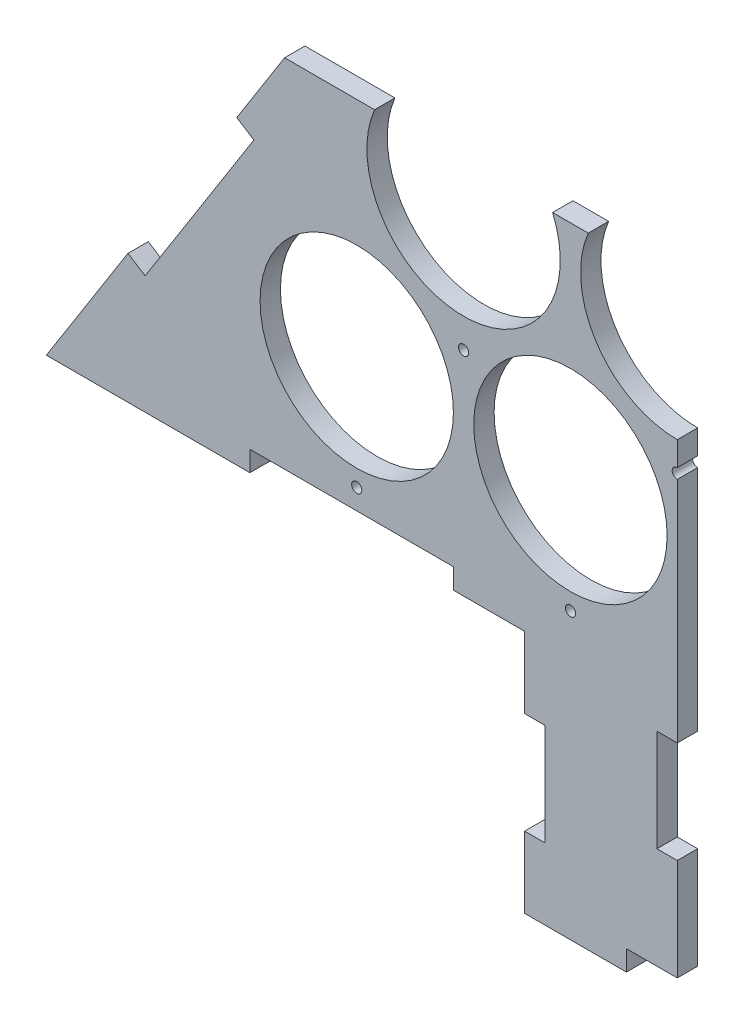
ISO-10303-21;
HEADER;
FILE_DESCRIPTION(('STEP AP214'),'2;1');
FILE_NAME('part.step','',(''),(''),'','','');
FILE_SCHEMA(('AUTOMOTIVE_DESIGN { 1 0 10303 214 1 1 1 1 }'));
ENDSEC;
DATA;
#1=APPLICATION_CONTEXT('core data for automotive mechanical design processes');
#2=APPLICATION_PROTOCOL_DEFINITION('international standard','automotive_design',2000,#1);
#3=PRODUCT_CONTEXT('',#1,'mechanical');
#4=PRODUCT('Part','Part','',(#3));
#5=PRODUCT_RELATED_PRODUCT_CATEGORY('part','',(#4));
#6=PRODUCT_DEFINITION_FORMATION('','',#4);
#7=PRODUCT_DEFINITION_CONTEXT('part definition',#1,'design');
#8=PRODUCT_DEFINITION('design','',#6,#7);
#9=PRODUCT_DEFINITION_SHAPE('','',#8);
#10=(LENGTH_UNIT() NAMED_UNIT(*) SI_UNIT(.MILLI.,.METRE.));
#11=(NAMED_UNIT(*) PLANE_ANGLE_UNIT() SI_UNIT($,.RADIAN.));
#12=(NAMED_UNIT(*) SI_UNIT($,.STERADIAN.) SOLID_ANGLE_UNIT());
#13=UNCERTAINTY_MEASURE_WITH_UNIT(LENGTH_MEASURE(1.E-05),#10,'distance_accuracy_value','');
#14=(GEOMETRIC_REPRESENTATION_CONTEXT(3) GLOBAL_UNCERTAINTY_ASSIGNED_CONTEXT((#13)) GLOBAL_UNIT_ASSIGNED_CONTEXT((#10,
#11,#12)) REPRESENTATION_CONTEXT('',''));
#15=CARTESIAN_POINT('',(0.,0.,0.));
#16=DIRECTION('',(0.,0.,1.));
#17=DIRECTION('',(1.,0.,0.));
#18=AXIS2_PLACEMENT_3D('',#15,#16,#17);
#19=CARTESIAN_POINT('',(0.,414.561180134828,0.));
#20=DIRECTION('',(-1.,0.,0.));
#21=DIRECTION('',(0.,0.,1.));
#22=AXIS2_PLACEMENT_3D('',#19,#20,#21);
#23=PLANE('',#22);
#24=DIRECTION('',(0.,-1.,0.));
#25=VECTOR('',#24,1.);
#26=CARTESIAN_POINT('',(0.,414.561180134828,0.));
#27=LINE('',#26,#25);
#28=CARTESIAN_POINT('',(0.,-135.642859016217,0.));
#29=VERTEX_POINT('',#28);
#30=CARTESIAN_POINT('',(0.,-185.642859016217,0.));
#31=VERTEX_POINT('',#30);
#32=EDGE_CURVE('E277',#29,#31,#27,.T.);
#33=ORIENTED_EDGE('',*,*,#32,.F.);
#34=DIRECTION('',(0.,0.,1.));
#35=VECTOR('',#34,1.);
#36=CARTESIAN_POINT('',(0.,-135.642859016217,0.));
#37=LINE('',#36,#35);
#38=CARTESIAN_POINT('',(0.,-135.642859016217,10.));
#39=VERTEX_POINT('',#38);
#40=EDGE_CURVE('E256',#29,#39,#37,.T.);
#41=ORIENTED_EDGE('',*,*,#40,.T.);
#42=DIRECTION('',(0.,-1.,0.));
#43=VECTOR('',#42,1.);
#44=CARTESIAN_POINT('',(0.,414.561180134828,10.));
#45=LINE('',#44,#43);
#46=CARTESIAN_POINT('',(0.,-185.642859016217,10.));
#47=VERTEX_POINT('',#46);
#48=EDGE_CURVE('E274',#39,#47,#45,.T.);
#49=ORIENTED_EDGE('',*,*,#48,.T.);
#50=DIRECTION('',(0.,0.,1.));
#51=VECTOR('',#50,1.);
#52=CARTESIAN_POINT('',(0.,-185.642859016217,0.));
#53=LINE('',#52,#51);
#54=EDGE_CURVE('E44',#31,#47,#53,.T.);
#55=ORIENTED_EDGE('',*,*,#54,.F.);
#56=EDGE_LOOP('',(#33,#41,#49,#55));
#57=FACE_BOUND('',#56,.T.);
#58=ADVANCED_FACE('F36',(#57),#23,.F.);
#59=CARTESIAN_POINT('',(-75.,-75.6428590162172,0.));
#60=DIRECTION('',(-1.,0.,0.));
#61=DIRECTION('',(0.,0.,1.));
#62=AXIS2_PLACEMENT_3D('',#59,#60,#61);
#63=PLANE('',#62);
#64=DIRECTION('',(0.,0.,1.));
#65=VECTOR('',#64,1.);
#66=CARTESIAN_POINT('',(-75.,-110.642859016217,0.));
#67=LINE('',#66,#65);
#68=CARTESIAN_POINT('',(-75.,-110.642859016217,0.));
#69=VERTEX_POINT('',#68);
#70=CARTESIAN_POINT('',(-75.,-110.642859016217,10.));
#71=VERTEX_POINT('',#70);
#72=EDGE_CURVE('E311',#69,#71,#67,.T.);
#73=ORIENTED_EDGE('',*,*,#72,.T.);
#74=DIRECTION('',(0.,-1.,0.));
#75=VECTOR('',#74,1.);
#76=CARTESIAN_POINT('',(-75.,-75.6428590162172,10.));
#77=LINE('',#76,#75);
#78=CARTESIAN_POINT('',(-75.,-75.6428590162172,10.));
#79=VERTEX_POINT('',#78);
#80=EDGE_CURVE('E341',#79,#71,#77,.T.);
#81=ORIENTED_EDGE('',*,*,#80,.F.);
#82=DIRECTION('',(0.,0.,1.));
#83=VECTOR('',#82,1.);
#84=CARTESIAN_POINT('',(-75.,-75.6428590162172,0.));
#85=LINE('',#84,#83);
#86=CARTESIAN_POINT('',(-75.,-75.6428590162172,0.));
#87=VERTEX_POINT('',#86);
#88=EDGE_CURVE('E347',#87,#79,#85,.T.);
#89=ORIENTED_EDGE('',*,*,#88,.F.);
#90=DIRECTION('',(0.,-1.,0.));
#91=VECTOR('',#90,1.);
#92=CARTESIAN_POINT('',(-75.,-75.6428590162172,0.));
#93=LINE('',#92,#91);
#94=EDGE_CURVE('E333',#87,#69,#93,.T.);
#95=ORIENTED_EDGE('',*,*,#94,.T.);
#96=EDGE_LOOP('',(#73,#81,#89,#95));
#97=FACE_BOUND('',#96,.T.);
#98=ADVANCED_FACE('F505',(#97),#63,.T.);
#99=CARTESIAN_POINT('',(-75.,-195.642859016217,0.));
#100=DIRECTION('',(0.,-1.,0.));
#101=DIRECTION('',(1.,0.,0.));
#102=AXIS2_PLACEMENT_3D('',#99,#100,#101);
#103=PLANE('',#102);
#104=DIRECTION('',(0.,0.,1.));
#105=VECTOR('',#104,1.);
#106=CARTESIAN_POINT('',(-25.,-195.642859016217,0.));
#107=LINE('',#106,#105);
#108=CARTESIAN_POINT('',(-25.,-195.642859016217,0.));
#109=VERTEX_POINT('',#108);
#110=CARTESIAN_POINT('',(-25.,-195.642859016217,10.));
#111=VERTEX_POINT('',#110);
#112=EDGE_CURVE('E326',#109,#111,#107,.T.);
#113=ORIENTED_EDGE('',*,*,#112,.T.);
#114=DIRECTION('',(1.,0.,0.));
#115=VECTOR('',#114,1.);
#116=CARTESIAN_POINT('',(-75.,-195.642859016217,10.));
#117=LINE('',#116,#115);
#118=CARTESIAN_POINT('',(-75.,-195.642859016217,10.));
#119=VERTEX_POINT('',#118);
#120=EDGE_CURVE('E344',#119,#111,#117,.T.);
#121=ORIENTED_EDGE('',*,*,#120,.F.);
#122=DIRECTION('',(0.,0.,1.));
#123=VECTOR('',#122,1.);
#124=CARTESIAN_POINT('',(-75.,-195.642859016217,0.));
#125=LINE('',#124,#123);
#126=CARTESIAN_POINT('',(-75.,-195.642859016217,0.));
#127=VERTEX_POINT('',#126);
#128=EDGE_CURVE('E340',#127,#119,#125,.T.);
#129=ORIENTED_EDGE('',*,*,#128,.F.);
#130=DIRECTION('',(1.,0.,0.));
#131=VECTOR('',#130,1.);
#132=CARTESIAN_POINT('',(-75.,-195.642859016217,0.));
#133=LINE('',#132,#131);
#134=EDGE_CURVE('E336',#127,#109,#133,.T.);
#135=ORIENTED_EDGE('',*,*,#134,.T.);
#136=EDGE_LOOP('',(#113,#121,#129,#135));
#137=FACE_BOUND('',#136,.T.);
#138=ADVANCED_FACE('F485',(#137),#103,.T.);
#139=CARTESIAN_POINT('',(310.,-75.6428590162171,10.));
#140=DIRECTION('',(0.,1.,0.));
#141=DIRECTION('',(-1.,0.,0.));
#142=AXIS2_PLACEMENT_3D('',#139,#140,#141);
#143=PLANE('',#142);
#144=DIRECTION('',(1.,0.,0.));
#145=VECTOR('',#144,1.);
#146=CARTESIAN_POINT('',(310.,-75.6428590162171,0.));
#147=LINE('',#146,#145);
#148=CARTESIAN_POINT('',(-110.,-75.6428590162172,0.));
#149=VERTEX_POINT('',#148);
#150=EDGE_CURVE('E448',#149,#87,#147,.T.);
#151=ORIENTED_EDGE('',*,*,#150,.T.);
#152=ORIENTED_EDGE('',*,*,#88,.T.);
#153=DIRECTION('',(1.,0.,0.));
#154=VECTOR('',#153,1.);
#155=CARTESIAN_POINT('',(310.,-75.6428590162171,10.));
#156=LINE('',#155,#154);
#157=CARTESIAN_POINT('',(-110.,-75.6428590162172,10.));
#158=VERTEX_POINT('',#157);
#159=EDGE_CURVE('E455',#158,#79,#156,.T.);
#160=ORIENTED_EDGE('',*,*,#159,.F.);
#161=DIRECTION('',(0.,0.,1.));
#162=VECTOR('',#161,1.);
#163=CARTESIAN_POINT('',(-110.,-75.6428590162172,0.));
#164=LINE('',#163,#162);
#165=EDGE_CURVE('E425',#149,#158,#164,.T.);
#166=ORIENTED_EDGE('',*,*,#165,.F.);
#167=EDGE_LOOP('',(#151,#152,#160,#166));
#168=FACE_BOUND('',#167,.T.);
#169=ADVANCED_FACE('F38',(#168),#143,.F.);
#170=CARTESIAN_POINT('',(-310.,-75.6428590162172,0.));
#171=VERTEX_POINT('',#170);
#172=CARTESIAN_POINT('',(-210.,-75.6428590162172,0.));
#173=VERTEX_POINT('',#172);
#174=EDGE_CURVE('E459',#171,#173,#147,.T.);
#175=ORIENTED_EDGE('',*,*,#174,.T.);
#176=DIRECTION('',(0.,0.,1.));
#177=VECTOR('',#176,1.);
#178=CARTESIAN_POINT('',(-210.,-75.6428590162172,0.));
#179=LINE('',#178,#177);
#180=CARTESIAN_POINT('',(-210.,-75.6428590162172,10.));
#181=VERTEX_POINT('',#180);
#182=EDGE_CURVE('E413',#173,#181,#179,.T.);
#183=ORIENTED_EDGE('',*,*,#182,.T.);
#184=CARTESIAN_POINT('',(-310.,-75.6428590162172,10.));
#185=VERTEX_POINT('',#184);
#186=EDGE_CURVE('E451',#185,#181,#156,.T.);
#187=ORIENTED_EDGE('',*,*,#186,.F.);
#188=DIRECTION('',(0.,0.,-1.));
#189=VECTOR('',#188,1.);
#190=CARTESIAN_POINT('',(-310.,-75.6428590162172,10.));
#191=LINE('',#190,#189);
#192=EDGE_CURVE('E458',#185,#171,#191,.T.);
#193=ORIENTED_EDGE('',*,*,#192,.T.);
#194=EDGE_LOOP('',(#175,#183,#187,#193));
#195=FACE_BOUND('',#194,.T.);
#196=ADVANCED_FACE('F608',(#195),#143,.F.);
#197=CARTESIAN_POINT('',(-310.,-75.6428590162172,10.));
#198=DIRECTION('',(0.845179377846631,-0.53448275862069,0.));
#199=DIRECTION('',(0.53448275862069,0.845179377846631,0.));
#200=AXIS2_PLACEMENT_3D('',#197,#198,#199);
#201=PLANE('',#200);
#202=DIRECTION('',(-0.53448275862069,-0.845179377846631,0.));
#203=VECTOR('',#202,1.);
#204=CARTESIAN_POINT('',(-310.,-75.6428590162172,10.));
#205=LINE('',#204,#203);
#206=CARTESIAN_POINT('',(-192.942106645631,109.461180134828,10.));
#207=VERTEX_POINT('',#206);
#208=CARTESIAN_POINT('',(-216.465517241379,72.2635321069431,10.));
#209=VERTEX_POINT('',#208);
#210=EDGE_CURVE('E456',#207,#209,#205,.T.);
#211=ORIENTED_EDGE('',*,*,#210,.F.);
#212=DIRECTION('',(0.,0.,-1.));
#213=VECTOR('',#212,1.);
#214=CARTESIAN_POINT('',(-192.942106645631,109.461180134828,10.));
#215=LINE('',#214,#213);
#216=CARTESIAN_POINT('',(-192.942106645631,109.461180134828,0.));
#217=VERTEX_POINT('',#216);
#218=EDGE_CURVE('E271',#207,#217,#215,.T.);
#219=ORIENTED_EDGE('',*,*,#218,.T.);
#220=DIRECTION('',(-0.53448275862069,-0.845179377846631,0.));
#221=VECTOR('',#220,1.);
#222=CARTESIAN_POINT('',(-310.,-75.6428590162172,0.));
#223=LINE('',#222,#221);
#224=CARTESIAN_POINT('',(-216.465517241379,72.2635321069431,0.));
#225=VERTEX_POINT('',#224);
#226=EDGE_CURVE('E463',#217,#225,#223,.T.);
#227=ORIENTED_EDGE('',*,*,#226,.T.);
#228=DIRECTION('',(0.,0.,1.));
#229=VECTOR('',#228,1.);
#230=CARTESIAN_POINT('',(-216.465517241379,72.2635321069431,0.));
#231=LINE('',#230,#229);
#232=EDGE_CURVE('E394',#225,#209,#231,.T.);
#233=ORIENTED_EDGE('',*,*,#232,.T.);
#234=EDGE_LOOP('',(#211,#219,#227,#233));
#235=FACE_BOUND('',#234,.T.);
#236=ADVANCED_FACE('F598',(#235),#201,.F.);
#237=CARTESIAN_POINT('',(0.,0.,10.));
#238=DIRECTION('',(0.,0.,-1.));
#239=DIRECTION('',(-1.,0.,0.));
#240=AXIS2_PLACEMENT_3D('',#237,#238,#239);
#241=PLANE('',#240);
#242=CARTESIAN_POINT('',(-157.5,-55.6428590162172,10.));
#243=DIRECTION('',(0.,0.,1.));
#244=DIRECTION('',(1.,0.,0.));
#245=AXIS2_PLACEMENT_3D('',#242,#243,#244);
#246=CIRCLE('',#245,2.5);
#247=CARTESIAN_POINT('',(-155.,-55.6428590162172,10.));
#248=VERTEX_POINT('',#247);
#249=EDGE_CURVE('E357',#248,#248,#246,.T.);
#250=ORIENTED_EDGE('',*,*,#249,.F.);
#251=EDGE_LOOP('',(#250));
#252=FACE_BOUND('',#251,.T.);
#253=CARTESIAN_POINT('',(-105.,29.0473750965556,10.));
#254=DIRECTION('',(0.,0.,1.));
#255=DIRECTION('',(1.,0.,0.));
#256=AXIS2_PLACEMENT_3D('',#253,#254,#255);
#257=CIRCLE('',#256,2.49999999999999);
#258=CARTESIAN_POINT('',(-102.5,29.0473750965556,10.));
#259=VERTEX_POINT('',#258);
#260=EDGE_CURVE('E363',#259,#259,#257,.T.);
#261=ORIENTED_EDGE('',*,*,#260,.F.);
#262=EDGE_LOOP('',(#261));
#263=FACE_BOUND('',#262,.T.);
#264=CARTESIAN_POINT('',(-52.5,-55.6428590162172,10.));
#265=DIRECTION('',(0.,0.,1.));
#266=DIRECTION('',(1.,0.,0.));
#267=AXIS2_PLACEMENT_3D('',#264,#265,#266);
#268=CIRCLE('',#267,2.5);
#269=CARTESIAN_POINT('',(-50.,-55.6428590162172,10.));
#270=VERTEX_POINT('',#269);
#271=EDGE_CURVE('E369',#270,#270,#268,.T.);
#272=ORIENTED_EDGE('',*,*,#271,.F.);
#273=EDGE_LOOP('',(#272));
#274=FACE_BOUND('',#273,.T.);
#275=CARTESIAN_POINT('',(-157.5,0.,10.));
#276=DIRECTION('',(0.,0.,1.));
#277=DIRECTION('',(1.,0.,0.));
#278=AXIS2_PLACEMENT_3D('',#275,#276,#277);
#279=CIRCLE('',#278,47.5);
#280=CARTESIAN_POINT('',(-110.,0.,10.));
#281=VERTEX_POINT('',#280);
#282=EDGE_CURVE('E445',#281,#281,#279,.T.);
#283=ORIENTED_EDGE('',*,*,#282,.F.);
#284=EDGE_LOOP('',(#283));
#285=FACE_BOUND('',#284,.T.);
#286=CARTESIAN_POINT('',(-52.5,0.,10.));
#287=DIRECTION('',(0.,0.,1.));
#288=DIRECTION('',(1.,0.,0.));
#289=AXIS2_PLACEMENT_3D('',#286,#287,#288);
#290=CIRCLE('',#289,47.5);
#291=CARTESIAN_POINT('',(-4.99999999999998,0.,10.));
#292=VERTEX_POINT('',#291);
#293=EDGE_CURVE('E439',#292,#292,#290,.T.);
#294=ORIENTED_EDGE('',*,*,#293,.F.);
#295=EDGE_LOOP('',(#294));
#296=FACE_BOUND('',#295,.T.);
#297=ORIENTED_EDGE('',*,*,#48,.F.);
#298=DIRECTION('',(1.,0.,0.));
#299=VECTOR('',#298,1.);
#300=CARTESIAN_POINT('',(0.,-135.642859016217,10.));
#301=LINE('',#300,#299);
#302=CARTESIAN_POINT('',(-10.,-135.642859016217,10.));
#303=VERTEX_POINT('',#302);
#304=EDGE_CURVE('E248',#303,#39,#301,.T.);
#305=ORIENTED_EDGE('',*,*,#304,.F.);
#306=DIRECTION('',(0.,-1.,0.));
#307=VECTOR('',#306,1.);
#308=CARTESIAN_POINT('',(-10.,-135.642859016217,10.));
#309=LINE('',#308,#307);
#310=CARTESIAN_POINT('',(-10.,-85.6428590162172,10.));
#311=VERTEX_POINT('',#310);
#312=EDGE_CURVE('E250',#311,#303,#309,.T.);
#313=ORIENTED_EDGE('',*,*,#312,.F.);
#314=DIRECTION('',(-1.,0.,0.));
#315=VECTOR('',#314,1.);
#316=CARTESIAN_POINT('',(0.,-85.6428590162172,10.));
#317=LINE('',#316,#315);
#318=CARTESIAN_POINT('',(0.,-85.6428590162172,10.));
#319=VERTEX_POINT('',#318);
#320=EDGE_CURVE('E228',#319,#311,#317,.T.);
#321=ORIENTED_EDGE('',*,*,#320,.F.);
#322=CARTESIAN_POINT('',(0.,26.5473750965556,10.));
#323=VERTEX_POINT('',#322);
#324=EDGE_CURVE('E278',#323,#319,#45,.T.);
#325=ORIENTED_EDGE('',*,*,#324,.F.);
#326=CARTESIAN_POINT('',(0.,29.0473750965556,10.));
#327=DIRECTION('',(0.,0.,1.));
#328=DIRECTION('',(1.,0.,0.));
#329=AXIS2_PLACEMENT_3D('',#326,#327,#328);
#330=CIRCLE('',#329,2.49999999999999);
#331=CARTESIAN_POINT('',(0.,31.5473750965556,10.));
#332=VERTEX_POINT('',#331);
#333=EDGE_CURVE('E350',#332,#323,#330,.T.);
#334=ORIENTED_EDGE('',*,*,#333,.F.);
#335=CARTESIAN_POINT('',(0.,43.432667397366,10.));
#336=VERTEX_POINT('',#335);
#337=EDGE_CURVE('E281',#336,#332,#45,.T.);
#338=ORIENTED_EDGE('',*,*,#337,.F.);
#339=CARTESIAN_POINT('',(0.,90.932667397366,10.));
#340=DIRECTION('',(0.,0.,1.));
#341=DIRECTION('',(1.,0.,0.));
#342=AXIS2_PLACEMENT_3D('',#339,#340,#341);
#343=CIRCLE('',#342,47.5);
#344=CARTESIAN_POINT('',(-43.7372177411607,109.461180134828,10.));
#345=VERTEX_POINT('',#344);
#346=EDGE_CURVE('E429',#345,#336,#343,.T.);
#347=ORIENTED_EDGE('',*,*,#346,.F.);
#348=DIRECTION('',(1.,0.,0.));
#349=VECTOR('',#348,1.);
#350=CARTESIAN_POINT('',(0.,109.461180134828,10.));
#351=LINE('',#350,#349);
#352=CARTESIAN_POINT('',(-61.2627822588393,109.461180134828,10.));
#353=VERTEX_POINT('',#352);
#354=EDGE_CURVE('E259',#353,#345,#351,.T.);
#355=ORIENTED_EDGE('',*,*,#354,.F.);
#356=CARTESIAN_POINT('',(-105.,90.932667397366,10.));
#357=DIRECTION('',(0.,0.,1.));
#358=DIRECTION('',(1.,0.,0.));
#359=AXIS2_PLACEMENT_3D('',#356,#357,#358);
#360=CIRCLE('',#359,47.5);
#361=CARTESIAN_POINT('',(-148.737217741161,109.461180134828,10.));
#362=VERTEX_POINT('',#361);
#363=EDGE_CURVE('E433',#362,#353,#360,.T.);
#364=ORIENTED_EDGE('',*,*,#363,.F.);
#365=EDGE_CURVE('E59',#207,#362,#351,.T.);
#366=ORIENTED_EDGE('',*,*,#365,.F.);
#367=ORIENTED_EDGE('',*,*,#210,.T.);
#368=DIRECTION('',(-0.84517937784663,0.534482758620691,0.));
#369=VECTOR('',#368,1.);
#370=CARTESIAN_POINT('',(-208.013723462913,66.9187045207363,10.));
#371=LINE('',#370,#369);
#372=CARTESIAN_POINT('',(-208.013723462913,66.9187045207363,10.));
#373=VERTEX_POINT('',#372);
#374=EDGE_CURVE('E380',#373,#209,#371,.T.);
#375=ORIENTED_EDGE('',*,*,#374,.F.);
#376=DIRECTION('',(0.534482758620691,0.84517937784663,0.));
#377=VECTOR('',#376,1.);
#378=CARTESIAN_POINT('',(-261.461999324982,-17.5992332639267,10.));
#379=LINE('',#378,#377);
#380=CARTESIAN_POINT('',(-261.461999324982,-17.5992332639267,10.));
#381=VERTEX_POINT('',#380);
#382=EDGE_CURVE('E389',#381,#373,#379,.T.);
#383=ORIENTED_EDGE('',*,*,#382,.F.);
#384=DIRECTION('',(0.84517937784663,-0.534482758620692,0.));
#385=VECTOR('',#384,1.);
#386=CARTESIAN_POINT('',(-269.913793103448,-12.2544056777198,10.));
#387=LINE('',#386,#385);
#388=CARTESIAN_POINT('',(-269.913793103448,-12.2544056777198,10.));
#389=VERTEX_POINT('',#388);
#390=EDGE_CURVE('E356',#389,#381,#387,.T.);
#391=ORIENTED_EDGE('',*,*,#390,.F.);
#392=EDGE_CURVE('E454',#389,#185,#205,.T.);
#393=ORIENTED_EDGE('',*,*,#392,.T.);
#394=ORIENTED_EDGE('',*,*,#186,.T.);
#395=DIRECTION('',(0.,-1.,0.));
#396=VECTOR('',#395,1.);
#397=CARTESIAN_POINT('',(-210.,-75.6428590162172,10.));
#398=LINE('',#397,#396);
#399=CARTESIAN_POINT('',(-210.,-65.6428590162172,10.));
#400=VERTEX_POINT('',#399);
#401=EDGE_CURVE('E397',#400,#181,#398,.T.);
#402=ORIENTED_EDGE('',*,*,#401,.F.);
#403=DIRECTION('',(-1.,0.,0.));
#404=VECTOR('',#403,1.);
#405=CARTESIAN_POINT('',(-210.,-65.6428590162172,10.));
#406=LINE('',#405,#404);
#407=CARTESIAN_POINT('',(-110.,-65.6428590162172,10.));
#408=VERTEX_POINT('',#407);
#409=EDGE_CURVE('E407',#408,#400,#406,.T.);
#410=ORIENTED_EDGE('',*,*,#409,.F.);
#411=DIRECTION('',(0.,1.,0.));
#412=VECTOR('',#411,1.);
#413=CARTESIAN_POINT('',(-110.,-75.6428590162172,10.));
#414=LINE('',#413,#412);
#415=EDGE_CURVE('E415',#158,#408,#414,.T.);
#416=ORIENTED_EDGE('',*,*,#415,.F.);
#417=ORIENTED_EDGE('',*,*,#159,.T.);
#418=ORIENTED_EDGE('',*,*,#80,.T.);
#419=DIRECTION('',(-1.,0.,0.));
#420=VECTOR('',#419,1.);
#421=CARTESIAN_POINT('',(-75.,-110.642859016217,10.));
#422=LINE('',#421,#420);
#423=CARTESIAN_POINT('',(-65.,-110.642859016217,10.));
#424=VERTEX_POINT('',#423);
#425=EDGE_CURVE('E296',#424,#71,#422,.T.);
#426=ORIENTED_EDGE('',*,*,#425,.F.);
#427=DIRECTION('',(0.,1.,0.));
#428=VECTOR('',#427,1.);
#429=CARTESIAN_POINT('',(-65.,-110.642859016217,10.));
#430=LINE('',#429,#428);
#431=CARTESIAN_POINT('',(-65.,-160.642859016217,10.));
#432=VERTEX_POINT('',#431);
#433=EDGE_CURVE('E306',#432,#424,#430,.T.);
#434=ORIENTED_EDGE('',*,*,#433,.F.);
#435=DIRECTION('',(1.,0.,0.));
#436=VECTOR('',#435,1.);
#437=CARTESIAN_POINT('',(-75.,-160.642859016217,10.));
#438=LINE('',#437,#436);
#439=CARTESIAN_POINT('',(-75.,-160.642859016217,10.));
#440=VERTEX_POINT('',#439);
#441=EDGE_CURVE('E303',#440,#432,#438,.T.);
#442=ORIENTED_EDGE('',*,*,#441,.F.);
#443=EDGE_CURVE('E314',#440,#119,#77,.T.);
#444=ORIENTED_EDGE('',*,*,#443,.T.);
#445=ORIENTED_EDGE('',*,*,#120,.T.);
#446=DIRECTION('',(0.,-1.,0.));
#447=VECTOR('',#446,1.);
#448=CARTESIAN_POINT('',(-25.,-195.642859016217,10.));
#449=LINE('',#448,#447);
#450=CARTESIAN_POINT('',(-25.,-185.642859016217,10.));
#451=VERTEX_POINT('',#450);
#452=EDGE_CURVE('E291',#451,#111,#449,.T.);
#453=ORIENTED_EDGE('',*,*,#452,.F.);
#454=DIRECTION('',(-1.,0.,0.));
#455=VECTOR('',#454,1.);
#456=CARTESIAN_POINT('',(-25.,-185.642859016217,10.));
#457=LINE('',#456,#455);
#458=EDGE_CURVE('E324',#47,#451,#457,.T.);
#459=ORIENTED_EDGE('',*,*,#458,.F.);
#460=EDGE_LOOP('',(#297,#305,#313,#321,#325,#334,#338,#347,#355,#364,#366,#367,#375,#383,#391,
#393,#394,#402,#410,#416,#417,#418,#426,#434,#442,#444,#445,#453,#459));
#461=FACE_BOUND('',#460,.T.);
#462=ADVANCED_FACE('F478',(#252,#263,#274,#285,#296,#461),#241,.F.);
#463=CARTESIAN_POINT('',(0.,0.,0.));
#464=DIRECTION('',(0.,0.,-1.));
#465=DIRECTION('',(-1.,0.,0.));
#466=AXIS2_PLACEMENT_3D('',#463,#464,#465);
#467=PLANE('',#466);
#468=DIRECTION('',(1.,0.,0.));
#469=VECTOR('',#468,1.);
#470=CARTESIAN_POINT('',(0.,-135.642859016217,0.));
#471=LINE('',#470,#469);
#472=CARTESIAN_POINT('',(-10.,-135.642859016217,0.));
#473=VERTEX_POINT('',#472);
#474=EDGE_CURVE('E241',#473,#29,#471,.T.);
#475=ORIENTED_EDGE('',*,*,#474,.T.);
#476=ORIENTED_EDGE('',*,*,#32,.T.);
#477=DIRECTION('',(-1.,0.,0.));
#478=VECTOR('',#477,1.);
#479=CARTESIAN_POINT('',(-25.,-185.642859016217,0.));
#480=LINE('',#479,#478);
#481=CARTESIAN_POINT('',(-25.,-185.642859016217,0.));
#482=VERTEX_POINT('',#481);
#483=EDGE_CURVE('E323',#31,#482,#480,.T.);
#484=ORIENTED_EDGE('',*,*,#483,.T.);
#485=DIRECTION('',(0.,-1.,0.));
#486=VECTOR('',#485,1.);
#487=CARTESIAN_POINT('',(-25.,-195.642859016217,0.));
#488=LINE('',#487,#486);
#489=EDGE_CURVE('E320',#482,#109,#488,.T.);
#490=ORIENTED_EDGE('',*,*,#489,.T.);
#491=ORIENTED_EDGE('',*,*,#134,.F.);
#492=CARTESIAN_POINT('',(-75.,-160.642859016217,0.));
#493=VERTEX_POINT('',#492);
#494=EDGE_CURVE('E337',#493,#127,#93,.T.);
#495=ORIENTED_EDGE('',*,*,#494,.F.);
#496=DIRECTION('',(1.,0.,0.));
#497=VECTOR('',#496,1.);
#498=CARTESIAN_POINT('',(-75.,-160.642859016217,0.));
#499=LINE('',#498,#497);
#500=CARTESIAN_POINT('',(-65.,-160.642859016217,0.));
#501=VERTEX_POINT('',#500);
#502=EDGE_CURVE('E292',#493,#501,#499,.T.);
#503=ORIENTED_EDGE('',*,*,#502,.T.);
#504=DIRECTION('',(0.,1.,0.));
#505=VECTOR('',#504,1.);
#506=CARTESIAN_POINT('',(-65.,-110.642859016217,0.));
#507=LINE('',#506,#505);
#508=CARTESIAN_POINT('',(-65.,-110.642859016217,0.));
#509=VERTEX_POINT('',#508);
#510=EDGE_CURVE('E295',#501,#509,#507,.T.);
#511=ORIENTED_EDGE('',*,*,#510,.T.);
#512=DIRECTION('',(-1.,0.,0.));
#513=VECTOR('',#512,1.);
#514=CARTESIAN_POINT('',(-75.,-110.642859016217,0.));
#515=LINE('',#514,#513);
#516=EDGE_CURVE('E299',#509,#69,#515,.T.);
#517=ORIENTED_EDGE('',*,*,#516,.T.);
#518=ORIENTED_EDGE('',*,*,#94,.F.);
#519=ORIENTED_EDGE('',*,*,#150,.F.);
#520=DIRECTION('',(0.,1.,0.));
#521=VECTOR('',#520,1.);
#522=CARTESIAN_POINT('',(-110.,-75.6428590162172,0.));
#523=LINE('',#522,#521);
#524=CARTESIAN_POINT('',(-110.,-65.6428590162172,0.));
#525=VERTEX_POINT('',#524);
#526=EDGE_CURVE('E406',#149,#525,#523,.T.);
#527=ORIENTED_EDGE('',*,*,#526,.T.);
#528=DIRECTION('',(-1.,0.,0.));
#529=VECTOR('',#528,1.);
#530=CARTESIAN_POINT('',(-210.,-65.6428590162172,0.));
#531=LINE('',#530,#529);
#532=CARTESIAN_POINT('',(-210.,-65.6428590162172,0.));
#533=VERTEX_POINT('',#532);
#534=EDGE_CURVE('E410',#525,#533,#531,.T.);
#535=ORIENTED_EDGE('',*,*,#534,.T.);
#536=DIRECTION('',(0.,-1.,0.));
#537=VECTOR('',#536,1.);
#538=CARTESIAN_POINT('',(-210.,-75.6428590162172,0.));
#539=LINE('',#538,#537);
#540=EDGE_CURVE('E403',#533,#173,#539,.T.);
#541=ORIENTED_EDGE('',*,*,#540,.T.);
#542=ORIENTED_EDGE('',*,*,#174,.F.);
#543=CARTESIAN_POINT('',(-269.913793103448,-12.2544056777201,0.));
#544=VERTEX_POINT('',#543);
#545=EDGE_CURVE('E462',#544,#171,#223,.T.);
#546=ORIENTED_EDGE('',*,*,#545,.F.);
#547=DIRECTION('',(0.84517937784663,-0.534482758620692,0.));
#548=VECTOR('',#547,1.);
#549=CARTESIAN_POINT('',(-269.913793103448,-12.2544056777198,0.));
#550=LINE('',#549,#548);
#551=CARTESIAN_POINT('',(-261.461999324982,-17.5992332639267,0.));
#552=VERTEX_POINT('',#551);
#553=EDGE_CURVE('E376',#544,#552,#550,.T.);
#554=ORIENTED_EDGE('',*,*,#553,.T.);
#555=DIRECTION('',(0.534482758620691,0.84517937784663,0.));
#556=VECTOR('',#555,1.);
#557=CARTESIAN_POINT('',(-261.461999324982,-17.5992332639267,0.));
#558=LINE('',#557,#556);
#559=CARTESIAN_POINT('',(-208.013723462913,66.9187045207363,0.));
#560=VERTEX_POINT('',#559);
#561=EDGE_CURVE('E379',#552,#560,#558,.T.);
#562=ORIENTED_EDGE('',*,*,#561,.T.);
#563=DIRECTION('',(-0.84517937784663,0.534482758620691,0.));
#564=VECTOR('',#563,1.);
#565=CARTESIAN_POINT('',(-208.013723462913,66.9187045207363,0.));
#566=LINE('',#565,#564);
#567=EDGE_CURVE('E383',#560,#225,#566,.T.);
#568=ORIENTED_EDGE('',*,*,#567,.T.);
#569=ORIENTED_EDGE('',*,*,#226,.F.);
#570=DIRECTION('',(1.,0.,0.));
#571=VECTOR('',#570,1.);
#572=CARTESIAN_POINT('',(0.,109.461180134828,0.));
#573=LINE('',#572,#571);
#574=CARTESIAN_POINT('',(-148.737217741161,109.461180134828,0.));
#575=VERTEX_POINT('',#574);
#576=EDGE_CURVE('E265',#217,#575,#573,.T.);
#577=ORIENTED_EDGE('',*,*,#576,.T.);
#578=CARTESIAN_POINT('',(-105.,90.932667397366,0.));
#579=DIRECTION('',(0.,0.,1.));
#580=DIRECTION('',(1.,0.,0.));
#581=AXIS2_PLACEMENT_3D('',#578,#579,#580);
#582=CIRCLE('',#581,47.5);
#583=CARTESIAN_POINT('',(-61.2627822588393,109.461180134828,0.));
#584=VERTEX_POINT('',#583);
#585=EDGE_CURVE('E431',#575,#584,#582,.T.);
#586=ORIENTED_EDGE('',*,*,#585,.T.);
#587=CARTESIAN_POINT('',(-43.7372177411607,109.461180134828,0.));
#588=VERTEX_POINT('',#587);
#589=EDGE_CURVE('E262',#584,#588,#573,.T.);
#590=ORIENTED_EDGE('',*,*,#589,.T.);
#591=CARTESIAN_POINT('',(0.,90.932667397366,0.));
#592=DIRECTION('',(0.,0.,1.));
#593=DIRECTION('',(1.,0.,0.));
#594=AXIS2_PLACEMENT_3D('',#591,#592,#593);
#595=CIRCLE('',#594,47.5);
#596=CARTESIAN_POINT('',(0.,43.432667397366,0.));
#597=VERTEX_POINT('',#596);
#598=EDGE_CURVE('E422',#588,#597,#595,.T.);
#599=ORIENTED_EDGE('',*,*,#598,.T.);
#600=CARTESIAN_POINT('',(0.,31.5473750965556,0.));
#601=VERTEX_POINT('',#600);
#602=EDGE_CURVE('E276',#597,#601,#27,.T.);
#603=ORIENTED_EDGE('',*,*,#602,.T.);
#604=CARTESIAN_POINT('',(0.,29.0473750965556,0.));
#605=DIRECTION('',(0.,0.,1.));
#606=DIRECTION('',(1.,0.,0.));
#607=AXIS2_PLACEMENT_3D('',#604,#605,#606);
#608=CIRCLE('',#607,2.49999999999999);
#609=CARTESIAN_POINT('',(0.,26.5473750965556,0.));
#610=VERTEX_POINT('',#609);
#611=EDGE_CURVE('E361',#601,#610,#608,.T.);
#612=ORIENTED_EDGE('',*,*,#611,.T.);
#613=CARTESIAN_POINT('',(0.,-85.6428590162172,0.));
#614=VERTEX_POINT('',#613);
#615=EDGE_CURVE('E247',#610,#614,#27,.T.);
#616=ORIENTED_EDGE('',*,*,#615,.T.);
#617=DIRECTION('',(-1.,0.,0.));
#618=VECTOR('',#617,1.);
#619=CARTESIAN_POINT('',(0.,-85.6428590162172,0.));
#620=LINE('',#619,#618);
#621=CARTESIAN_POINT('',(-10.,-85.6428590162172,0.));
#622=VERTEX_POINT('',#621);
#623=EDGE_CURVE('E51',#614,#622,#620,.T.);
#624=ORIENTED_EDGE('',*,*,#623,.T.);
#625=DIRECTION('',(0.,-1.,0.));
#626=VECTOR('',#625,1.);
#627=CARTESIAN_POINT('',(-10.,-135.642859016217,0.));
#628=LINE('',#627,#626);
#629=EDGE_CURVE('E236',#622,#473,#628,.T.);
#630=ORIENTED_EDGE('',*,*,#629,.T.);
#631=EDGE_LOOP('',(#475,#476,#484,#490,#491,#495,#503,#511,#517,#518,#519,#527,#535,#541,#542,
#546,#554,#562,#568,#569,#577,#586,#590,#599,#603,#612,#616,#624,#630));
#632=FACE_BOUND('',#631,.T.);
#633=CARTESIAN_POINT('',(-157.5,-55.6428590162172,0.));
#634=DIRECTION('',(0.,0.,1.));
#635=DIRECTION('',(1.,0.,0.));
#636=AXIS2_PLACEMENT_3D('',#633,#634,#635);
#637=CIRCLE('',#636,2.5);
#638=CARTESIAN_POINT('',(-155.,-55.6428590162172,0.));
#639=VERTEX_POINT('',#638);
#640=EDGE_CURVE('E353',#639,#639,#637,.T.);
#641=ORIENTED_EDGE('',*,*,#640,.T.);
#642=EDGE_LOOP('',(#641));
#643=FACE_BOUND('',#642,.T.);
#644=CARTESIAN_POINT('',(-105.,29.0473750965556,0.));
#645=DIRECTION('',(0.,0.,1.));
#646=DIRECTION('',(1.,0.,0.));
#647=AXIS2_PLACEMENT_3D('',#644,#645,#646);
#648=CIRCLE('',#647,2.49999999999999);
#649=CARTESIAN_POINT('',(-102.5,29.0473750965556,0.));
#650=VERTEX_POINT('',#649);
#651=EDGE_CURVE('E366',#650,#650,#648,.T.);
#652=ORIENTED_EDGE('',*,*,#651,.T.);
#653=EDGE_LOOP('',(#652));
#654=FACE_BOUND('',#653,.T.);
#655=CARTESIAN_POINT('',(-52.5,-55.6428590162172,0.));
#656=DIRECTION('',(0.,0.,1.));
#657=DIRECTION('',(1.,0.,0.));
#658=AXIS2_PLACEMENT_3D('',#655,#656,#657);
#659=CIRCLE('',#658,2.5);
#660=CARTESIAN_POINT('',(-50.,-55.6428590162172,0.));
#661=VERTEX_POINT('',#660);
#662=EDGE_CURVE('E360',#661,#661,#659,.T.);
#663=ORIENTED_EDGE('',*,*,#662,.T.);
#664=EDGE_LOOP('',(#663));
#665=FACE_BOUND('',#664,.T.);
#666=CARTESIAN_POINT('',(-157.5,0.,0.));
#667=DIRECTION('',(0.,0.,1.));
#668=DIRECTION('',(1.,0.,0.));
#669=AXIS2_PLACEMENT_3D('',#666,#667,#668);
#670=CIRCLE('',#669,47.5);
#671=CARTESIAN_POINT('',(-110.,0.,0.));
#672=VERTEX_POINT('',#671);
#673=EDGE_CURVE('E442',#672,#672,#670,.T.);
#674=ORIENTED_EDGE('',*,*,#673,.T.);
#675=EDGE_LOOP('',(#674));
#676=FACE_BOUND('',#675,.T.);
#677=CARTESIAN_POINT('',(-52.5,0.,0.));
#678=DIRECTION('',(0.,0.,1.));
#679=DIRECTION('',(1.,0.,0.));
#680=AXIS2_PLACEMENT_3D('',#677,#678,#679);
#681=CIRCLE('',#680,47.5);
#682=CARTESIAN_POINT('',(-4.99999999999998,0.,0.));
#683=VERTEX_POINT('',#682);
#684=EDGE_CURVE('E436',#683,#683,#681,.T.);
#685=ORIENTED_EDGE('',*,*,#684,.T.);
#686=EDGE_LOOP('',(#685));
#687=FACE_BOUND('',#686,.T.);
#688=ADVANCED_FACE('F244',(#632,#643,#654,#665,#676,#687),#467,.T.);
#689=ORIENTED_EDGE('',*,*,#392,.F.);
#690=DIRECTION('',(0.,0.,1.));
#691=VECTOR('',#690,1.);
#692=CARTESIAN_POINT('',(-269.913793103448,-12.2544056777198,0.));
#693=LINE('',#692,#691);
#694=EDGE_CURVE('E386',#544,#389,#693,.T.);
#695=ORIENTED_EDGE('',*,*,#694,.F.);
#696=ORIENTED_EDGE('',*,*,#545,.T.);
#697=ORIENTED_EDGE('',*,*,#192,.F.);
#698=EDGE_LOOP('',(#689,#695,#696,#697));
#699=FACE_BOUND('',#698,.T.);
#700=ADVANCED_FACE('F594',(#699),#201,.F.);
#701=CARTESIAN_POINT('',(-157.5,0.,10.));
#702=DIRECTION('',(0.,0.,-1.));
#703=DIRECTION('',(-1.,0.,0.));
#704=AXIS2_PLACEMENT_3D('',#701,#702,#703);
#705=CYLINDRICAL_SURFACE('',#704,47.5);
#706=ORIENTED_EDGE('',*,*,#282,.T.);
#707=EDGE_LOOP('',(#706));
#708=FACE_BOUND('',#707,.T.);
#709=ORIENTED_EDGE('',*,*,#673,.F.);
#710=EDGE_LOOP('',(#709));
#711=FACE_BOUND('',#710,.T.);
#712=ADVANCED_FACE('F590',(#708,#711),#705,.F.);
#713=CARTESIAN_POINT('',(-52.5,0.,10.));
#714=DIRECTION('',(0.,0.,-1.));
#715=DIRECTION('',(-1.,0.,0.));
#716=AXIS2_PLACEMENT_3D('',#713,#714,#715);
#717=CYLINDRICAL_SURFACE('',#716,47.5);
#718=ORIENTED_EDGE('',*,*,#293,.T.);
#719=EDGE_LOOP('',(#718));
#720=FACE_BOUND('',#719,.T.);
#721=ORIENTED_EDGE('',*,*,#684,.F.);
#722=EDGE_LOOP('',(#721));
#723=FACE_BOUND('',#722,.T.);
#724=ADVANCED_FACE('F586',(#720,#723),#717,.F.);
#725=CARTESIAN_POINT('',(-105.,90.932667397366,10.));
#726=DIRECTION('',(0.,0.,-1.));
#727=DIRECTION('',(-1.,0.,0.));
#728=AXIS2_PLACEMENT_3D('',#725,#726,#727);
#729=CYLINDRICAL_SURFACE('',#728,47.5);
#730=DIRECTION('',(0.,0.,-1.));
#731=VECTOR('',#730,1.);
#732=CARTESIAN_POINT('',(-148.737217741161,109.461180134828,10.));
#733=LINE('',#732,#731);
#734=EDGE_CURVE('E269',#362,#575,#733,.T.);
#735=ORIENTED_EDGE('',*,*,#734,.F.);
#736=ORIENTED_EDGE('',*,*,#363,.T.);
#737=DIRECTION('',(0.,0.,-1.));
#738=VECTOR('',#737,1.);
#739=CARTESIAN_POINT('',(-61.2627822588393,109.461180134828,10.));
#740=LINE('',#739,#738);
#741=EDGE_CURVE('E267',#584,#353,#740,.F.);
#742=ORIENTED_EDGE('',*,*,#741,.F.);
#743=ORIENTED_EDGE('',*,*,#585,.F.);
#744=EDGE_LOOP('',(#735,#736,#742,#743));
#745=FACE_BOUND('',#744,.T.);
#746=ADVANCED_FACE('F582',(#745),#729,.F.);
#747=CARTESIAN_POINT('',(0.,90.932667397366,10.));
#748=DIRECTION('',(0.,0.,-1.));
#749=DIRECTION('',(-1.,0.,0.));
#750=AXIS2_PLACEMENT_3D('',#747,#748,#749);
#751=CYLINDRICAL_SURFACE('',#750,47.5);
#752=DIRECTION('',(0.,0.,-1.));
#753=VECTOR('',#752,1.);
#754=CARTESIAN_POINT('',(-43.7372177411607,109.461180134828,10.));
#755=LINE('',#754,#753);
#756=EDGE_CURVE('E11',#345,#588,#755,.T.);
#757=ORIENTED_EDGE('',*,*,#756,.F.);
#758=ORIENTED_EDGE('',*,*,#346,.T.);
#759=DIRECTION('',(0.,0.,-1.));
#760=VECTOR('',#759,1.);
#761=CARTESIAN_POINT('',(0.,43.432667397366,10.));
#762=LINE('',#761,#760);
#763=EDGE_CURVE('E288',#597,#336,#762,.F.);
#764=ORIENTED_EDGE('',*,*,#763,.F.);
#765=ORIENTED_EDGE('',*,*,#598,.F.);
#766=EDGE_LOOP('',(#757,#758,#764,#765));
#767=FACE_BOUND('',#766,.T.);
#768=ADVANCED_FACE('F560',(#767),#751,.F.);
#769=CARTESIAN_POINT('',(-208.013723462913,66.9187045207363,0.));
#770=DIRECTION('',(0.534482758620691,0.84517937784663,0.));
#771=DIRECTION('',(-0.84517937784663,0.534482758620691,0.));
#772=AXIS2_PLACEMENT_3D('',#769,#770,#771);
#773=PLANE('',#772);
#774=ORIENTED_EDGE('',*,*,#374,.T.);
#775=ORIENTED_EDGE('',*,*,#232,.F.);
#776=ORIENTED_EDGE('',*,*,#567,.F.);
#777=DIRECTION('',(0.,0.,1.));
#778=VECTOR('',#777,1.);
#779=CARTESIAN_POINT('',(-208.013723462913,66.9187045207363,0.));
#780=LINE('',#779,#778);
#781=EDGE_CURVE('E398',#560,#373,#780,.T.);
#782=ORIENTED_EDGE('',*,*,#781,.T.);
#783=EDGE_LOOP('',(#774,#775,#776,#782));
#784=FACE_BOUND('',#783,.T.);
#785=ADVANCED_FACE('F556',(#784),#773,.F.);
#786=CARTESIAN_POINT('',(-261.461999324982,-17.5992332639267,0.));
#787=DIRECTION('',(0.84517937784663,-0.534482758620691,0.));
#788=DIRECTION('',(0.534482758620691,0.84517937784663,0.));
#789=AXIS2_PLACEMENT_3D('',#786,#787,#788);
#790=PLANE('',#789);
#791=ORIENTED_EDGE('',*,*,#382,.T.);
#792=ORIENTED_EDGE('',*,*,#781,.F.);
#793=ORIENTED_EDGE('',*,*,#561,.F.);
#794=DIRECTION('',(0.,0.,1.));
#795=VECTOR('',#794,1.);
#796=CARTESIAN_POINT('',(-261.461999324982,-17.5992332639267,0.));
#797=LINE('',#796,#795);
#798=EDGE_CURVE('E400',#552,#381,#797,.T.);
#799=ORIENTED_EDGE('',*,*,#798,.T.);
#800=EDGE_LOOP('',(#791,#792,#793,#799));
#801=FACE_BOUND('',#800,.T.);
#802=ADVANCED_FACE('F559',(#801),#790,.F.);
#803=CARTESIAN_POINT('',(-269.913793103448,-12.2544056777198,0.));
#804=DIRECTION('',(-0.534482758620692,-0.845179377846629,0.));
#805=DIRECTION('',(0.845179377846629,-0.534482758620692,0.));
#806=AXIS2_PLACEMENT_3D('',#803,#804,#805);
#807=PLANE('',#806);
#808=ORIENTED_EDGE('',*,*,#390,.T.);
#809=ORIENTED_EDGE('',*,*,#798,.F.);
#810=ORIENTED_EDGE('',*,*,#553,.F.);
#811=ORIENTED_EDGE('',*,*,#694,.T.);
#812=EDGE_LOOP('',(#808,#809,#810,#811));
#813=FACE_BOUND('',#812,.T.);
#814=ADVANCED_FACE('F564',(#813),#807,.F.);
#815=CARTESIAN_POINT('',(-210.,-75.6428590162172,0.));
#816=DIRECTION('',(-1.,0.,0.));
#817=DIRECTION('',(0.,0.,1.));
#818=AXIS2_PLACEMENT_3D('',#815,#816,#817);
#819=PLANE('',#818);
#820=ORIENTED_EDGE('',*,*,#401,.T.);
#821=ORIENTED_EDGE('',*,*,#182,.F.);
#822=ORIENTED_EDGE('',*,*,#540,.F.);
#823=DIRECTION('',(0.,0.,1.));
#824=VECTOR('',#823,1.);
#825=CARTESIAN_POINT('',(-210.,-65.6428590162172,0.));
#826=LINE('',#825,#824);
#827=EDGE_CURVE('E420',#533,#400,#826,.T.);
#828=ORIENTED_EDGE('',*,*,#827,.T.);
#829=EDGE_LOOP('',(#820,#821,#822,#828));
#830=FACE_BOUND('',#829,.T.);
#831=ADVANCED_FACE('F568',(#830),#819,.F.);
#832=CARTESIAN_POINT('',(-210.,-65.6428590162172,0.));
#833=DIRECTION('',(0.,1.,0.));
#834=DIRECTION('',(0.,0.,1.));
#835=AXIS2_PLACEMENT_3D('',#832,#833,#834);
#836=PLANE('',#835);
#837=ORIENTED_EDGE('',*,*,#409,.T.);
#838=ORIENTED_EDGE('',*,*,#827,.F.);
#839=ORIENTED_EDGE('',*,*,#534,.F.);
#840=DIRECTION('',(0.,0.,1.));
#841=VECTOR('',#840,1.);
#842=CARTESIAN_POINT('',(-110.,-65.6428590162172,0.));
#843=LINE('',#842,#841);
#844=EDGE_CURVE('E423',#525,#408,#843,.T.);
#845=ORIENTED_EDGE('',*,*,#844,.T.);
#846=EDGE_LOOP('',(#837,#838,#839,#845));
#847=FACE_BOUND('',#846,.T.);
#848=ADVANCED_FACE('F570',(#847),#836,.F.);
#849=CARTESIAN_POINT('',(-110.,-75.6428590162172,0.));
#850=DIRECTION('',(1.,0.,0.));
#851=DIRECTION('',(0.,0.,-1.));
#852=AXIS2_PLACEMENT_3D('',#849,#850,#851);
#853=PLANE('',#852);
#854=ORIENTED_EDGE('',*,*,#415,.T.);
#855=ORIENTED_EDGE('',*,*,#844,.F.);
#856=ORIENTED_EDGE('',*,*,#526,.F.);
#857=ORIENTED_EDGE('',*,*,#165,.T.);
#858=EDGE_LOOP('',(#854,#855,#856,#857));
#859=FACE_BOUND('',#858,.T.);
#860=ADVANCED_FACE('F549',(#859),#853,.F.);
#861=CARTESIAN_POINT('',(0.,29.0473750965556,0.));
#862=DIRECTION('',(0.,0.,1.));
#863=DIRECTION('',(1.,0.,0.));
#864=AXIS2_PLACEMENT_3D('',#861,#862,#863);
#865=CYLINDRICAL_SURFACE('',#864,2.49999999999999);
#866=ORIENTED_EDGE('',*,*,#333,.T.);
#867=DIRECTION('',(0.,0.,1.));
#868=VECTOR('',#867,1.);
#869=CARTESIAN_POINT('',(0.,26.5473750965556,0.));
#870=LINE('',#869,#868);
#871=EDGE_CURVE('E285',#323,#610,#870,.F.);
#872=ORIENTED_EDGE('',*,*,#871,.T.);
#873=ORIENTED_EDGE('',*,*,#611,.F.);
#874=DIRECTION('',(0.,0.,1.));
#875=VECTOR('',#874,1.);
#876=CARTESIAN_POINT('',(0.,31.5473750965556,0.));
#877=LINE('',#876,#875);
#878=EDGE_CURVE('E282',#601,#332,#877,.T.);
#879=ORIENTED_EDGE('',*,*,#878,.T.);
#880=EDGE_LOOP('',(#866,#872,#873,#879));
#881=FACE_BOUND('',#880,.T.);
#882=ADVANCED_FACE('F496',(#881),#865,.F.);
#883=CARTESIAN_POINT('',(-52.5,-55.6428590162172,0.));
#884=DIRECTION('',(0.,0.,1.));
#885=DIRECTION('',(1.,0.,0.));
#886=AXIS2_PLACEMENT_3D('',#883,#884,#885);
#887=CYLINDRICAL_SURFACE('',#886,2.5);
#888=ORIENTED_EDGE('',*,*,#662,.F.);
#889=EDGE_LOOP('',(#888));
#890=FACE_BOUND('',#889,.T.);
#891=ORIENTED_EDGE('',*,*,#271,.T.);
#892=EDGE_LOOP('',(#891));
#893=FACE_BOUND('',#892,.T.);
#894=ADVANCED_FACE('F548',(#890,#893),#887,.F.);
#895=CARTESIAN_POINT('',(-105.,29.0473750965556,0.));
#896=DIRECTION('',(0.,0.,1.));
#897=DIRECTION('',(1.,0.,0.));
#898=AXIS2_PLACEMENT_3D('',#895,#896,#897);
#899=CYLINDRICAL_SURFACE('',#898,2.49999999999999);
#900=ORIENTED_EDGE('',*,*,#651,.F.);
#901=EDGE_LOOP('',(#900));
#902=FACE_BOUND('',#901,.T.);
#903=ORIENTED_EDGE('',*,*,#260,.T.);
#904=EDGE_LOOP('',(#903));
#905=FACE_BOUND('',#904,.T.);
#906=ADVANCED_FACE('F544',(#902,#905),#899,.F.);
#907=CARTESIAN_POINT('',(-157.5,-55.6428590162172,0.));
#908=DIRECTION('',(0.,0.,1.));
#909=DIRECTION('',(1.,0.,0.));
#910=AXIS2_PLACEMENT_3D('',#907,#908,#909);
#911=CYLINDRICAL_SURFACE('',#910,2.5);
#912=ORIENTED_EDGE('',*,*,#640,.F.);
#913=EDGE_LOOP('',(#912));
#914=FACE_BOUND('',#913,.T.);
#915=ORIENTED_EDGE('',*,*,#249,.T.);
#916=EDGE_LOOP('',(#915));
#917=FACE_BOUND('',#916,.T.);
#918=ADVANCED_FACE('F540',(#914,#917),#911,.F.);
#919=DIRECTION('',(0.,0.,1.));
#920=VECTOR('',#919,1.);
#921=CARTESIAN_POINT('',(-75.,-160.642859016217,0.));
#922=LINE('',#921,#920);
#923=EDGE_CURVE('E302',#493,#440,#922,.T.);
#924=ORIENTED_EDGE('',*,*,#923,.F.);
#925=ORIENTED_EDGE('',*,*,#494,.T.);
#926=ORIENTED_EDGE('',*,*,#128,.T.);
#927=ORIENTED_EDGE('',*,*,#443,.F.);
#928=EDGE_LOOP('',(#924,#925,#926,#927));
#929=FACE_BOUND('',#928,.T.);
#930=ADVANCED_FACE('F515',(#929),#63,.T.);
#931=CARTESIAN_POINT('',(-25.,-195.642859016217,0.));
#932=DIRECTION('',(-1.,0.,0.));
#933=DIRECTION('',(0.,0.,1.));
#934=AXIS2_PLACEMENT_3D('',#931,#932,#933);
#935=PLANE('',#934);
#936=ORIENTED_EDGE('',*,*,#452,.T.);
#937=ORIENTED_EDGE('',*,*,#112,.F.);
#938=ORIENTED_EDGE('',*,*,#489,.F.);
#939=DIRECTION('',(0.,0.,1.));
#940=VECTOR('',#939,1.);
#941=CARTESIAN_POINT('',(-25.,-185.642859016217,0.));
#942=LINE('',#941,#940);
#943=EDGE_CURVE('E307',#482,#451,#942,.T.);
#944=ORIENTED_EDGE('',*,*,#943,.T.);
#945=EDGE_LOOP('',(#936,#937,#938,#944));
#946=FACE_BOUND('',#945,.T.);
#947=ADVANCED_FACE('F482',(#946),#935,.F.);
#948=CARTESIAN_POINT('',(-25.,-185.642859016217,0.));
#949=DIRECTION('',(0.,1.,0.));
#950=DIRECTION('',(0.,0.,1.));
#951=AXIS2_PLACEMENT_3D('',#948,#949,#950);
#952=PLANE('',#951);
#953=ORIENTED_EDGE('',*,*,#483,.F.);
#954=ORIENTED_EDGE('',*,*,#54,.T.);
#955=ORIENTED_EDGE('',*,*,#458,.T.);
#956=ORIENTED_EDGE('',*,*,#943,.F.);
#957=EDGE_LOOP('',(#953,#954,#955,#956));
#958=FACE_BOUND('',#957,.T.);
#959=ADVANCED_FACE('F471',(#958),#952,.F.);
#960=CARTESIAN_POINT('',(-75.,-110.642859016217,0.));
#961=DIRECTION('',(0.,1.,0.));
#962=DIRECTION('',(0.,0.,1.));
#963=AXIS2_PLACEMENT_3D('',#960,#961,#962);
#964=PLANE('',#963);
#965=ORIENTED_EDGE('',*,*,#425,.T.);
#966=ORIENTED_EDGE('',*,*,#72,.F.);
#967=ORIENTED_EDGE('',*,*,#516,.F.);
#968=DIRECTION('',(0.,0.,1.));
#969=VECTOR('',#968,1.);
#970=CARTESIAN_POINT('',(-65.,-110.642859016217,0.));
#971=LINE('',#970,#969);
#972=EDGE_CURVE('E315',#509,#424,#971,.T.);
#973=ORIENTED_EDGE('',*,*,#972,.T.);
#974=EDGE_LOOP('',(#965,#966,#967,#973));
#975=FACE_BOUND('',#974,.T.);
#976=ADVANCED_FACE('F529',(#975),#964,.F.);
#977=CARTESIAN_POINT('',(-65.,-110.642859016217,0.));
#978=DIRECTION('',(1.,0.,0.));
#979=DIRECTION('',(0.,1.,0.));
#980=AXIS2_PLACEMENT_3D('',#977,#978,#979);
#981=PLANE('',#980);
#982=ORIENTED_EDGE('',*,*,#433,.T.);
#983=ORIENTED_EDGE('',*,*,#972,.F.);
#984=ORIENTED_EDGE('',*,*,#510,.F.);
#985=DIRECTION('',(0.,0.,1.));
#986=VECTOR('',#985,1.);
#987=CARTESIAN_POINT('',(-65.,-160.642859016217,0.));
#988=LINE('',#987,#986);
#989=EDGE_CURVE('E317',#501,#432,#988,.T.);
#990=ORIENTED_EDGE('',*,*,#989,.T.);
#991=EDGE_LOOP('',(#982,#983,#984,#990));
#992=FACE_BOUND('',#991,.T.);
#993=ADVANCED_FACE('F523',(#992),#981,.F.);
#994=CARTESIAN_POINT('',(-75.,-160.642859016217,0.));
#995=DIRECTION('',(0.,-1.,0.));
#996=DIRECTION('',(0.,0.,-1.));
#997=AXIS2_PLACEMENT_3D('',#994,#995,#996);
#998=PLANE('',#997);
#999=ORIENTED_EDGE('',*,*,#441,.T.);
#1000=ORIENTED_EDGE('',*,*,#989,.F.);
#1001=ORIENTED_EDGE('',*,*,#502,.F.);
#1002=ORIENTED_EDGE('',*,*,#923,.T.);
#1003=EDGE_LOOP('',(#999,#1000,#1001,#1002));
#1004=FACE_BOUND('',#1003,.T.);
#1005=ADVANCED_FACE('F520',(#1004),#998,.F.);
#1006=ORIENTED_EDGE('',*,*,#324,.T.);
#1007=DIRECTION('',(0.,0.,1.));
#1008=VECTOR('',#1007,1.);
#1009=CARTESIAN_POINT('',(0.,-85.6428590162172,0.));
#1010=LINE('',#1009,#1008);
#1011=EDGE_CURVE('E233',#614,#319,#1010,.T.);
#1012=ORIENTED_EDGE('',*,*,#1011,.F.);
#1013=ORIENTED_EDGE('',*,*,#615,.F.);
#1014=ORIENTED_EDGE('',*,*,#871,.F.);
#1015=EDGE_LOOP('',(#1006,#1012,#1013,#1014));
#1016=FACE_BOUND('',#1015,.T.);
#1017=ADVANCED_FACE('F500',(#1016),#23,.F.);
#1018=ORIENTED_EDGE('',*,*,#763,.T.);
#1019=ORIENTED_EDGE('',*,*,#337,.T.);
#1020=ORIENTED_EDGE('',*,*,#878,.F.);
#1021=ORIENTED_EDGE('',*,*,#602,.F.);
#1022=EDGE_LOOP('',(#1018,#1019,#1020,#1021));
#1023=FACE_BOUND('',#1022,.T.);
#1024=ADVANCED_FACE('F507',(#1023),#23,.F.);
#1025=CARTESIAN_POINT('',(0.,109.461180134828,0.));
#1026=DIRECTION('',(0.,-1.,0.));
#1027=DIRECTION('',(0.,0.,-1.));
#1028=AXIS2_PLACEMENT_3D('',#1025,#1026,#1027);
#1029=PLANE('',#1028);
#1030=ORIENTED_EDGE('',*,*,#741,.T.);
#1031=ORIENTED_EDGE('',*,*,#354,.T.);
#1032=ORIENTED_EDGE('',*,*,#756,.T.);
#1033=ORIENTED_EDGE('',*,*,#589,.F.);
#1034=EDGE_LOOP('',(#1030,#1031,#1032,#1033));
#1035=FACE_BOUND('',#1034,.T.);
#1036=ADVANCED_FACE('F519',(#1035),#1029,.F.);
#1037=ORIENTED_EDGE('',*,*,#365,.T.);
#1038=ORIENTED_EDGE('',*,*,#734,.T.);
#1039=ORIENTED_EDGE('',*,*,#576,.F.);
#1040=ORIENTED_EDGE('',*,*,#218,.F.);
#1041=EDGE_LOOP('',(#1037,#1038,#1039,#1040));
#1042=FACE_BOUND('',#1041,.T.);
#1043=ADVANCED_FACE('F684',(#1042),#1029,.F.);
#1044=CARTESIAN_POINT('',(0.,-135.642859016217,0.));
#1045=DIRECTION('',(0.,-1.,0.));
#1046=DIRECTION('',(0.,0.,-1.));
#1047=AXIS2_PLACEMENT_3D('',#1044,#1045,#1046);
#1048=PLANE('',#1047);
#1049=ORIENTED_EDGE('',*,*,#304,.T.);
#1050=ORIENTED_EDGE('',*,*,#40,.F.);
#1051=ORIENTED_EDGE('',*,*,#474,.F.);
#1052=DIRECTION('',(0.,0.,1.));
#1053=VECTOR('',#1052,1.);
#1054=CARTESIAN_POINT('',(-10.,-135.642859016217,0.));
#1055=LINE('',#1054,#1053);
#1056=EDGE_CURVE('E232',#473,#303,#1055,.T.);
#1057=ORIENTED_EDGE('',*,*,#1056,.T.);
#1058=EDGE_LOOP('',(#1049,#1050,#1051,#1057));
#1059=FACE_BOUND('',#1058,.T.);
#1060=ADVANCED_FACE('F503',(#1059),#1048,.F.);
#1061=CARTESIAN_POINT('',(-10.,-135.642859016217,0.));
#1062=DIRECTION('',(-1.,0.,0.));
#1063=DIRECTION('',(0.,0.,1.));
#1064=AXIS2_PLACEMENT_3D('',#1061,#1062,#1063);
#1065=PLANE('',#1064);
#1066=ORIENTED_EDGE('',*,*,#312,.T.);
#1067=ORIENTED_EDGE('',*,*,#1056,.F.);
#1068=ORIENTED_EDGE('',*,*,#629,.F.);
#1069=DIRECTION('',(0.,0.,1.));
#1070=VECTOR('',#1069,1.);
#1071=CARTESIAN_POINT('',(-10.,-85.6428590162172,0.));
#1072=LINE('',#1071,#1070);
#1073=EDGE_CURVE('E224',#622,#311,#1072,.T.);
#1074=ORIENTED_EDGE('',*,*,#1073,.T.);
#1075=EDGE_LOOP('',(#1066,#1067,#1068,#1074));
#1076=FACE_BOUND('',#1075,.T.);
#1077=ADVANCED_FACE('F237',(#1076),#1065,.F.);
#1078=CARTESIAN_POINT('',(0.,-85.6428590162172,0.));
#1079=DIRECTION('',(0.,1.,0.));
#1080=DIRECTION('',(0.,0.,1.));
#1081=AXIS2_PLACEMENT_3D('',#1078,#1079,#1080);
#1082=PLANE('',#1081);
#1083=ORIENTED_EDGE('',*,*,#320,.T.);
#1084=ORIENTED_EDGE('',*,*,#1073,.F.);
#1085=ORIENTED_EDGE('',*,*,#623,.F.);
#1086=ORIENTED_EDGE('',*,*,#1011,.T.);
#1087=EDGE_LOOP('',(#1083,#1084,#1085,#1086));
#1088=FACE_BOUND('',#1087,.T.);
#1089=ADVANCED_FACE('F226',(#1088),#1082,.F.);
#1090=CLOSED_SHELL('',(#58,#98,#138,#169,#196,#236,#462,#688,#700,#712,#724,#746,#768,#785,#802,
#814,#831,#848,#860,#882,#894,#906,#918,#930,#947,#959,#976,#993,#1005,#1017,#1024,#1036,#1043,
#1060,#1077,#1089));
#1091=MANIFOLD_SOLID_BREP('B2',#1090);
#1092=ADVANCED_BREP_SHAPE_REPRESENTATION('',(#18,#1091),#14);
#1093=SHAPE_DEFINITION_REPRESENTATION(#9,#1092);
ENDSEC;
END-ISO-10303-21;
